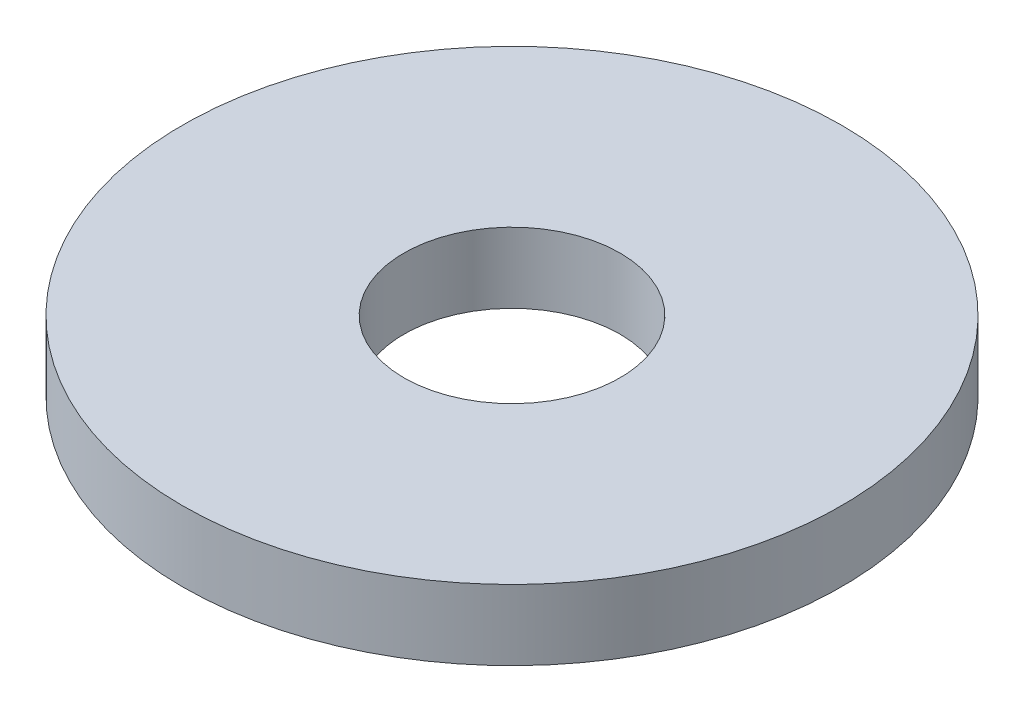
ISO-10303-21;
HEADER;
FILE_DESCRIPTION(('STEP AP214'),'2;1');
FILE_NAME('part.step','',(''),(''),'','','');
FILE_SCHEMA(('AUTOMOTIVE_DESIGN { 1 0 10303 214 1 1 1 1 }'));
ENDSEC;
DATA;
#1=APPLICATION_CONTEXT('core data for automotive mechanical design processes');
#2=APPLICATION_PROTOCOL_DEFINITION('international standard','automotive_design',2000,#1);
#3=PRODUCT_CONTEXT('',#1,'mechanical');
#4=PRODUCT('Part','Part','',(#3));
#5=PRODUCT_RELATED_PRODUCT_CATEGORY('part','',(#4));
#6=PRODUCT_DEFINITION_FORMATION('','',#4);
#7=PRODUCT_DEFINITION_CONTEXT('part definition',#1,'design');
#8=PRODUCT_DEFINITION('design','',#6,#7);
#9=PRODUCT_DEFINITION_SHAPE('','',#8);
#10=(LENGTH_UNIT() NAMED_UNIT(*) SI_UNIT(.MILLI.,.METRE.));
#11=(NAMED_UNIT(*) PLANE_ANGLE_UNIT() SI_UNIT($,.RADIAN.));
#12=(NAMED_UNIT(*) SI_UNIT($,.STERADIAN.) SOLID_ANGLE_UNIT());
#13=UNCERTAINTY_MEASURE_WITH_UNIT(LENGTH_MEASURE(1.E-05),#10,'distance_accuracy_value','');
#14=(GEOMETRIC_REPRESENTATION_CONTEXT(3) GLOBAL_UNCERTAINTY_ASSIGNED_CONTEXT((#13)) GLOBAL_UNIT_ASSIGNED_CONTEXT((#10,
#11,#12)) REPRESENTATION_CONTEXT('',''));
#15=CARTESIAN_POINT('',(0.,0.,0.));
#16=DIRECTION('',(0.,0.,1.));
#17=DIRECTION('',(1.,0.,0.));
#18=AXIS2_PLACEMENT_3D('',#15,#16,#17);
#19=CARTESIAN_POINT('',(0.,1.,0.));
#20=DIRECTION('',(0.,1.,0.));
#21=DIRECTION('',(0.,0.,-1.));
#22=AXIS2_PLACEMENT_3D('',#19,#20,#21);
#23=PLANE('',#22);
#24=CARTESIAN_POINT('',(0.,1.,0.));
#25=DIRECTION('',(0.,-1.,0.));
#26=DIRECTION('',(0.,0.,-1.));
#27=AXIS2_PLACEMENT_3D('',#24,#25,#26);
#28=CIRCLE('',#27,9.375);
#29=CARTESIAN_POINT('',(0.,1.,-9.375));
#30=VERTEX_POINT('',#29);
#31=EDGE_CURVE('E10',#30,#30,#28,.T.);
#32=ORIENTED_EDGE('',*,*,#31,.F.);
#33=EDGE_LOOP('',(#32));
#34=FACE_BOUND('',#33,.T.);
#35=CARTESIAN_POINT('',(0.,1.,0.));
#36=DIRECTION('',(0.,-1.,0.));
#37=DIRECTION('',(0.,0.,-1.));
#38=AXIS2_PLACEMENT_3D('',#35,#36,#37);
#39=CIRCLE('',#38,3.075);
#40=CARTESIAN_POINT('',(0.,1.,-3.075));
#41=VERTEX_POINT('',#40);
#42=EDGE_CURVE('E44',#41,#41,#39,.T.);
#43=ORIENTED_EDGE('',*,*,#42,.T.);
#44=EDGE_LOOP('',(#43));
#45=FACE_BOUND('',#44,.T.);
#46=ADVANCED_FACE('F33',(#34,#45),#23,.T.);
#47=CARTESIAN_POINT('',(0.,-1.,0.));
#48=DIRECTION('',(0.,1.,0.));
#49=DIRECTION('',(0.,0.,-1.));
#50=AXIS2_PLACEMENT_3D('',#47,#48,#49);
#51=PLANE('',#50);
#52=CARTESIAN_POINT('',(0.,-1.,0.));
#53=DIRECTION('',(0.,-1.,0.));
#54=DIRECTION('',(0.,0.,-1.));
#55=AXIS2_PLACEMENT_3D('',#52,#53,#54);
#56=CIRCLE('',#55,9.375);
#57=CARTESIAN_POINT('',(0.,-1.,-9.375));
#58=VERTEX_POINT('',#57);
#59=EDGE_CURVE('E37',#58,#58,#56,.T.);
#60=ORIENTED_EDGE('',*,*,#59,.T.);
#61=EDGE_LOOP('',(#60));
#62=FACE_BOUND('',#61,.T.);
#63=CARTESIAN_POINT('',(0.,-1.,0.));
#64=DIRECTION('',(0.,-1.,0.));
#65=DIRECTION('',(0.,0.,-1.));
#66=AXIS2_PLACEMENT_3D('',#63,#64,#65);
#67=CIRCLE('',#66,3.075);
#68=CARTESIAN_POINT('',(0.,-1.,-3.075));
#69=VERTEX_POINT('',#68);
#70=EDGE_CURVE('E46',#69,#69,#67,.T.);
#71=ORIENTED_EDGE('',*,*,#70,.F.);
#72=EDGE_LOOP('',(#71));
#73=FACE_BOUND('',#72,.T.);
#74=ADVANCED_FACE('F59',(#62,#73),#51,.F.);
#75=CARTESIAN_POINT('',(0.,1.,0.));
#76=DIRECTION('',(0.,-1.,0.));
#77=DIRECTION('',(0.,0.,1.));
#78=AXIS2_PLACEMENT_3D('',#75,#76,#77);
#79=CYLINDRICAL_SURFACE('',#78,9.375);
#80=ORIENTED_EDGE('',*,*,#31,.T.);
#81=EDGE_LOOP('',(#80));
#82=FACE_BOUND('',#81,.T.);
#83=ORIENTED_EDGE('',*,*,#59,.F.);
#84=EDGE_LOOP('',(#83));
#85=FACE_BOUND('',#84,.T.);
#86=ADVANCED_FACE('F35',(#82,#85),#79,.T.);
#87=CARTESIAN_POINT('',(0.,1.,0.));
#88=DIRECTION('',(0.,-1.,0.));
#89=DIRECTION('',(0.,0.,1.));
#90=AXIS2_PLACEMENT_3D('',#87,#88,#89);
#91=CYLINDRICAL_SURFACE('',#90,3.075);
#92=ORIENTED_EDGE('',*,*,#42,.F.);
#93=EDGE_LOOP('',(#92));
#94=FACE_BOUND('',#93,.T.);
#95=ORIENTED_EDGE('',*,*,#70,.T.);
#96=EDGE_LOOP('',(#95));
#97=FACE_BOUND('',#96,.T.);
#98=ADVANCED_FACE('F53',(#94,#97),#91,.F.);
#99=CLOSED_SHELL('',(#46,#74,#86,#98));
#100=MANIFOLD_SOLID_BREP('B2',#99);
#101=ADVANCED_BREP_SHAPE_REPRESENTATION('',(#18,#100),#14);
#102=SHAPE_DEFINITION_REPRESENTATION(#9,#101);
ENDSEC;
END-ISO-10303-21;
